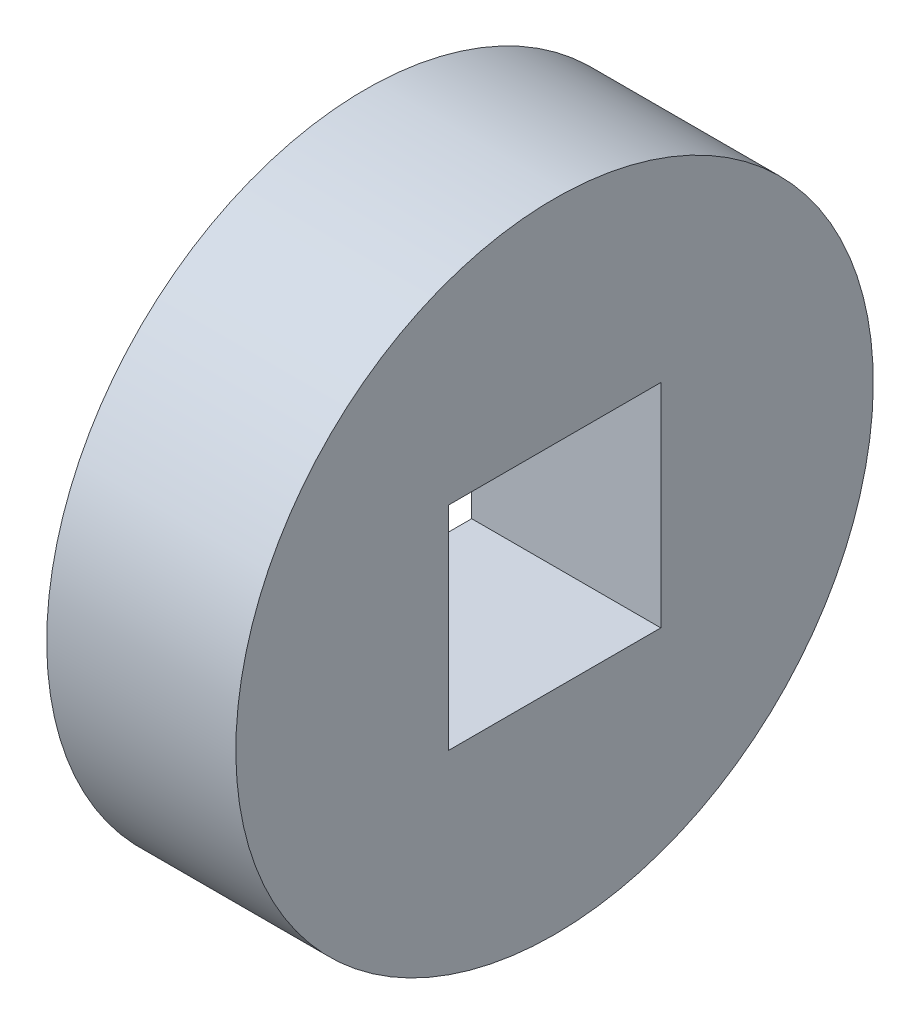
ISO-10303-21;
HEADER;
FILE_DESCRIPTION(('STEP AP214'),'2;1');
FILE_NAME('part.step','',(''),(''),'','','');
FILE_SCHEMA(('AUTOMOTIVE_DESIGN { 1 0 10303 214 1 1 1 1 }'));
ENDSEC;
DATA;
#1=APPLICATION_CONTEXT('core data for automotive mechanical design processes');
#2=APPLICATION_PROTOCOL_DEFINITION('international standard','automotive_design',2000,#1);
#3=PRODUCT_CONTEXT('',#1,'mechanical');
#4=PRODUCT('Part','Part','',(#3));
#5=PRODUCT_RELATED_PRODUCT_CATEGORY('part','',(#4));
#6=PRODUCT_DEFINITION_FORMATION('','',#4);
#7=PRODUCT_DEFINITION_CONTEXT('part definition',#1,'design');
#8=PRODUCT_DEFINITION('design','',#6,#7);
#9=PRODUCT_DEFINITION_SHAPE('','',#8);
#10=(LENGTH_UNIT() NAMED_UNIT(*) SI_UNIT(.MILLI.,.METRE.));
#11=(NAMED_UNIT(*) PLANE_ANGLE_UNIT() SI_UNIT($,.RADIAN.));
#12=(NAMED_UNIT(*) SI_UNIT($,.STERADIAN.) SOLID_ANGLE_UNIT());
#13=UNCERTAINTY_MEASURE_WITH_UNIT(LENGTH_MEASURE(1.E-05),#10,'distance_accuracy_value','');
#14=(GEOMETRIC_REPRESENTATION_CONTEXT(3) GLOBAL_UNCERTAINTY_ASSIGNED_CONTEXT((#13)) GLOBAL_UNIT_ASSIGNED_CONTEXT((#10,
#11,#12)) REPRESENTATION_CONTEXT('',''));
#15=CARTESIAN_POINT('',(0.,0.,0.));
#16=DIRECTION('',(0.,0.,1.));
#17=DIRECTION('',(1.,0.,0.));
#18=AXIS2_PLACEMENT_3D('',#15,#16,#17);
#19=CARTESIAN_POINT('',(-176.403,0.,1704.975));
#20=DIRECTION('',(0.,0.,1.));
#21=DIRECTION('',(1.,0.,0.));
#22=AXIS2_PLACEMENT_3D('',#19,#20,#21);
#23=PLANE('',#22);
#24=DIRECTION('',(0.,-1.,0.));
#25=VECTOR('',#24,1.);
#26=CARTESIAN_POINT('',(-165.1,0.,1704.975));
#27=LINE('',#26,#25);
#28=CARTESIAN_POINT('',(-165.1,6.34999999999989,1704.975));
#29=VERTEX_POINT('',#28);
#30=CARTESIAN_POINT('',(-165.1,-6.35000000000012,1704.975));
#31=VERTEX_POINT('',#30);
#32=EDGE_CURVE('E109',#29,#31,#27,.T.);
#33=ORIENTED_EDGE('',*,*,#32,.F.);
#34=DIRECTION('',(1.,0.,0.));
#35=VECTOR('',#34,1.);
#36=CARTESIAN_POINT('',(-176.403,6.34999999999989,1704.975));
#37=LINE('',#36,#35);
#38=CARTESIAN_POINT('',(-176.403,6.34999999999989,1704.975));
#39=VERTEX_POINT('',#38);
#40=EDGE_CURVE('E9',#39,#29,#37,.T.);
#41=ORIENTED_EDGE('',*,*,#40,.F.);
#42=DIRECTION('',(0.,-1.,0.));
#43=VECTOR('',#42,1.);
#44=CARTESIAN_POINT('',(-176.403,0.,1704.975));
#45=LINE('',#44,#43);
#46=CARTESIAN_POINT('',(-176.403,-6.35000000000012,1704.975));
#47=VERTEX_POINT('',#46);
#48=EDGE_CURVE('E92',#39,#47,#45,.T.);
#49=ORIENTED_EDGE('',*,*,#48,.T.);
#50=DIRECTION('',(1.,0.,0.));
#51=VECTOR('',#50,1.);
#52=CARTESIAN_POINT('',(-176.403,-6.35000000000012,1704.975));
#53=LINE('',#52,#51);
#54=EDGE_CURVE('E68',#47,#31,#53,.T.);
#55=ORIENTED_EDGE('',*,*,#54,.T.);
#56=EDGE_LOOP('',(#33,#41,#49,#55));
#57=FACE_BOUND('',#56,.T.);
#58=ADVANCED_FACE('F14',(#57),#23,.T.);
#59=CARTESIAN_POINT('',(-176.403,6.34999999999988,1714.83011894226));
#60=DIRECTION('',(0.,-1.,0.));
#61=DIRECTION('',(0.,0.,-1.));
#62=AXIS2_PLACEMENT_3D('',#59,#60,#61);
#63=PLANE('',#62);
#64=DIRECTION('',(0.,0.,-1.));
#65=VECTOR('',#64,1.);
#66=CARTESIAN_POINT('',(-165.1,6.34999999999988,1714.83011894226));
#67=LINE('',#66,#65);
#68=CARTESIAN_POINT('',(-165.1,6.34999999999988,1717.675));
#69=VERTEX_POINT('',#68);
#70=EDGE_CURVE('E82',#69,#29,#67,.T.);
#71=ORIENTED_EDGE('',*,*,#70,.F.);
#72=DIRECTION('',(1.,0.,0.));
#73=VECTOR('',#72,1.);
#74=CARTESIAN_POINT('',(-176.403,6.34999999999988,1717.675));
#75=LINE('',#74,#73);
#76=CARTESIAN_POINT('',(-176.403,6.34999999999988,1717.675));
#77=VERTEX_POINT('',#76);
#78=EDGE_CURVE('E24',#77,#69,#75,.T.);
#79=ORIENTED_EDGE('',*,*,#78,.F.);
#80=DIRECTION('',(0.,0.,-1.));
#81=VECTOR('',#80,1.);
#82=CARTESIAN_POINT('',(-176.403,6.34999999999988,1714.83011894226));
#83=LINE('',#82,#81);
#84=EDGE_CURVE('E80',#77,#39,#83,.T.);
#85=ORIENTED_EDGE('',*,*,#84,.T.);
#86=ORIENTED_EDGE('',*,*,#40,.T.);
#87=EDGE_LOOP('',(#71,#79,#85,#86));
#88=FACE_BOUND('',#87,.T.);
#89=ADVANCED_FACE('F78',(#88),#63,.T.);
#90=CARTESIAN_POINT('',(-176.403,-2.90317127257596,1717.675));
#91=DIRECTION('',(0.,0.,1.));
#92=DIRECTION('',(1.,0.,0.));
#93=AXIS2_PLACEMENT_3D('',#90,#91,#92);
#94=PLANE('',#93);
#95=DIRECTION('',(0.,-1.,0.));
#96=VECTOR('',#95,1.);
#97=CARTESIAN_POINT('',(-165.1,-2.90317127257596,1717.675));
#98=LINE('',#97,#96);
#99=CARTESIAN_POINT('',(-165.1,-6.35000000000012,1717.675));
#100=VERTEX_POINT('',#99);
#101=EDGE_CURVE('E113',#69,#100,#98,.T.);
#102=ORIENTED_EDGE('',*,*,#101,.T.);
#103=DIRECTION('',(1.,0.,0.));
#104=VECTOR('',#103,1.);
#105=CARTESIAN_POINT('',(-176.403,-6.35000000000012,1717.675));
#106=LINE('',#105,#104);
#107=CARTESIAN_POINT('',(-176.403,-6.35000000000012,1717.675));
#108=VERTEX_POINT('',#107);
#109=EDGE_CURVE('E85',#108,#100,#106,.T.);
#110=ORIENTED_EDGE('',*,*,#109,.F.);
#111=DIRECTION('',(0.,-1.,0.));
#112=VECTOR('',#111,1.);
#113=CARTESIAN_POINT('',(-176.403,-2.90317127257596,1717.675));
#114=LINE('',#113,#112);
#115=EDGE_CURVE('E87',#77,#108,#114,.T.);
#116=ORIENTED_EDGE('',*,*,#115,.F.);
#117=ORIENTED_EDGE('',*,*,#78,.T.);
#118=EDGE_LOOP('',(#102,#110,#116,#117));
#119=FACE_BOUND('',#118,.T.);
#120=ADVANCED_FACE('F88',(#119),#94,.F.);
#121=CARTESIAN_POINT('',(-176.403,0.,1711.325));
#122=DIRECTION('',(1.,0.,0.));
#123=DIRECTION('',(0.,0.,-1.));
#124=AXIS2_PLACEMENT_3D('',#121,#122,#123);
#125=CYLINDRICAL_SURFACE('',#124,19.05);
#126=CARTESIAN_POINT('',(-176.403,0.,1711.325));
#127=DIRECTION('',(-1.,0.,0.));
#128=DIRECTION('',(0.,-1.,0.));
#129=AXIS2_PLACEMENT_3D('',#126,#127,#128);
#130=CIRCLE('',#129,19.05);
#131=CARTESIAN_POINT('',(-176.403,-19.0500000000001,1711.325));
#132=VERTEX_POINT('',#131);
#133=EDGE_CURVE('E99',#132,#132,#130,.T.);
#134=ORIENTED_EDGE('',*,*,#133,.F.);
#135=EDGE_LOOP('',(#134));
#136=FACE_BOUND('',#135,.T.);
#137=CARTESIAN_POINT('',(-165.1,0.,1711.325));
#138=DIRECTION('',(-1.,0.,0.));
#139=DIRECTION('',(0.,-1.,0.));
#140=AXIS2_PLACEMENT_3D('',#137,#138,#139);
#141=CIRCLE('',#140,19.05);
#142=CARTESIAN_POINT('',(-165.1,-19.0500000000001,1711.325));
#143=VERTEX_POINT('',#142);
#144=EDGE_CURVE('E105',#143,#143,#141,.T.);
#145=ORIENTED_EDGE('',*,*,#144,.T.);
#146=EDGE_LOOP('',(#145));
#147=FACE_BOUND('',#146,.T.);
#148=ADVANCED_FACE('F16',(#136,#147),#125,.T.);
#149=CARTESIAN_POINT('',(-176.403,-6.35000000000012,1714.83011894226));
#150=DIRECTION('',(0.,-1.,0.));
#151=DIRECTION('',(0.,0.,-1.));
#152=AXIS2_PLACEMENT_3D('',#149,#150,#151);
#153=PLANE('',#152);
#154=DIRECTION('',(0.,0.,-1.));
#155=VECTOR('',#154,1.);
#156=CARTESIAN_POINT('',(-165.1,-6.35000000000012,1714.83011894226));
#157=LINE('',#156,#155);
#158=EDGE_CURVE('E59',#100,#31,#157,.T.);
#159=ORIENTED_EDGE('',*,*,#158,.T.);
#160=ORIENTED_EDGE('',*,*,#54,.F.);
#161=DIRECTION('',(0.,0.,-1.));
#162=VECTOR('',#161,1.);
#163=CARTESIAN_POINT('',(-176.403,-6.35000000000012,1714.83011894226));
#164=LINE('',#163,#162);
#165=EDGE_CURVE('E37',#108,#47,#164,.T.);
#166=ORIENTED_EDGE('',*,*,#165,.F.);
#167=ORIENTED_EDGE('',*,*,#109,.T.);
#168=EDGE_LOOP('',(#159,#160,#166,#167));
#169=FACE_BOUND('',#168,.T.);
#170=ADVANCED_FACE('F122',(#169),#153,.F.);
#171=CARTESIAN_POINT('',(-176.403,0.,1711.325));
#172=DIRECTION('',(-1.,0.,0.));
#173=DIRECTION('',(0.,-1.,0.));
#174=AXIS2_PLACEMENT_3D('',#171,#172,#173);
#175=PLANE('',#174);
#176=ORIENTED_EDGE('',*,*,#133,.T.);
#177=EDGE_LOOP('',(#176));
#178=FACE_BOUND('',#177,.T.);
#179=ORIENTED_EDGE('',*,*,#48,.F.);
#180=ORIENTED_EDGE('',*,*,#84,.F.);
#181=ORIENTED_EDGE('',*,*,#115,.T.);
#182=ORIENTED_EDGE('',*,*,#165,.T.);
#183=EDGE_LOOP('',(#179,#180,#181,#182));
#184=FACE_BOUND('',#183,.T.);
#185=ADVANCED_FACE('F91',(#178,#184),#175,.T.);
#186=CARTESIAN_POINT('',(-165.1,0.,1711.325));
#187=DIRECTION('',(-1.,0.,0.));
#188=DIRECTION('',(0.,-1.,0.));
#189=AXIS2_PLACEMENT_3D('',#186,#187,#188);
#190=PLANE('',#189);
#191=ORIENTED_EDGE('',*,*,#144,.F.);
#192=EDGE_LOOP('',(#191));
#193=FACE_BOUND('',#192,.T.);
#194=ORIENTED_EDGE('',*,*,#32,.T.);
#195=ORIENTED_EDGE('',*,*,#158,.F.);
#196=ORIENTED_EDGE('',*,*,#101,.F.);
#197=ORIENTED_EDGE('',*,*,#70,.T.);
#198=EDGE_LOOP('',(#194,#195,#196,#197));
#199=FACE_BOUND('',#198,.T.);
#200=ADVANCED_FACE('F123',(#193,#199),#190,.F.);
#201=CLOSED_SHELL('',(#58,#89,#120,#148,#170,#185,#200));
#202=MANIFOLD_SOLID_BREP('B1',#201);
#203=ADVANCED_BREP_SHAPE_REPRESENTATION('',(#18,#202),#14);
#204=SHAPE_DEFINITION_REPRESENTATION(#9,#203);
ENDSEC;
END-ISO-10303-21;
